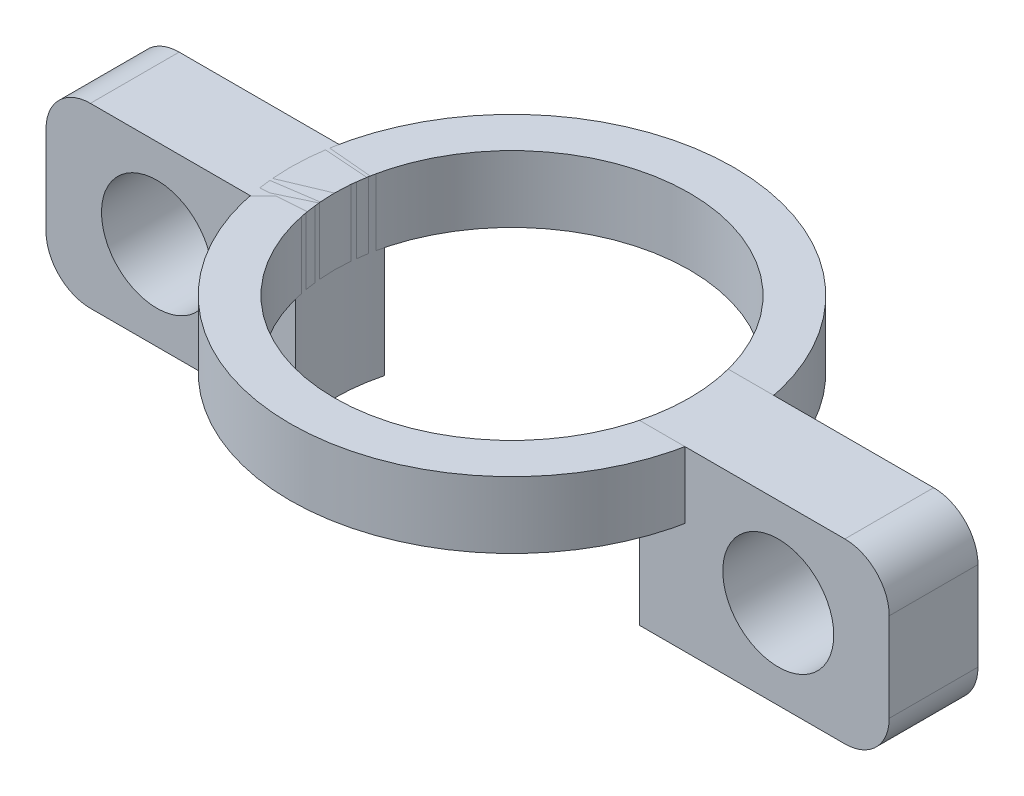
ISO-10303-21;
HEADER;
FILE_DESCRIPTION(('STEP AP214'),'2;1');
FILE_NAME('part.step','',(''),(''),'','','');
FILE_SCHEMA(('AUTOMOTIVE_DESIGN { 1 0 10303 214 1 1 1 1 }'));
ENDSEC;
DATA;
#1=APPLICATION_CONTEXT('core data for automotive mechanical design processes');
#2=APPLICATION_PROTOCOL_DEFINITION('international standard','automotive_design',2000,#1);
#3=PRODUCT_CONTEXT('',#1,'mechanical');
#4=PRODUCT('Part','Part','',(#3));
#5=PRODUCT_RELATED_PRODUCT_CATEGORY('part','',(#4));
#6=PRODUCT_DEFINITION_FORMATION('','',#4);
#7=PRODUCT_DEFINITION_CONTEXT('part definition',#1,'design');
#8=PRODUCT_DEFINITION('design','',#6,#7);
#9=PRODUCT_DEFINITION_SHAPE('','',#8);
#10=(LENGTH_UNIT() NAMED_UNIT(*) SI_UNIT(.MILLI.,.METRE.));
#11=(NAMED_UNIT(*) PLANE_ANGLE_UNIT() SI_UNIT($,.RADIAN.));
#12=(NAMED_UNIT(*) SI_UNIT($,.STERADIAN.) SOLID_ANGLE_UNIT());
#13=UNCERTAINTY_MEASURE_WITH_UNIT(LENGTH_MEASURE(1.E-05),#10,'distance_accuracy_value','');
#14=(GEOMETRIC_REPRESENTATION_CONTEXT(3) GLOBAL_UNCERTAINTY_ASSIGNED_CONTEXT((#13)) GLOBAL_UNIT_ASSIGNED_CONTEXT((#10,
#11,#12)) REPRESENTATION_CONTEXT('',''));
#15=CARTESIAN_POINT('',(0.,0.,0.));
#16=DIRECTION('',(0.,0.,1.));
#17=DIRECTION('',(1.,0.,0.));
#18=AXIS2_PLACEMENT_3D('',#15,#16,#17);
#19=CARTESIAN_POINT('',(0.,-50.,0.));
#20=DIRECTION('',(0.,1.,0.));
#21=DIRECTION('',(0.,0.,1.));
#22=AXIS2_PLACEMENT_3D('',#19,#20,#21);
#23=CYLINDRICAL_SURFACE('',#22,10.);
#24=CARTESIAN_POINT('',(0.,-50.,0.));
#25=DIRECTION('',(0.,1.,0.));
#26=DIRECTION('',(1.,0.,0.));
#27=AXIS2_PLACEMENT_3D('',#24,#25,#26);
#28=CIRCLE('',#27,10.);
#29=CARTESIAN_POINT('',(10.,-50.,0.));
#30=VERTEX_POINT('',#29);
#31=EDGE_CURVE('E12',#30,#30,#28,.T.);
#32=ORIENTED_EDGE('',*,*,#31,.T.);
#33=EDGE_LOOP('',(#32));
#34=FACE_BOUND('',#33,.T.);
#35=CARTESIAN_POINT('',(0.,-47.,0.));
#36=DIRECTION('',(0.,1.,0.));
#37=DIRECTION('',(1.,0.,0.));
#38=AXIS2_PLACEMENT_3D('',#35,#36,#37);
#39=CIRCLE('',#38,10.);
#40=CARTESIAN_POINT('',(10.,-47.,0.));
#41=VERTEX_POINT('',#40);
#42=EDGE_CURVE('E51',#41,#41,#39,.T.);
#43=ORIENTED_EDGE('',*,*,#42,.F.);
#44=EDGE_LOOP('',(#43));
#45=FACE_BOUND('',#44,.T.);
#46=ADVANCED_FACE('F48',(#34,#45),#23,.T.);
#47=CARTESIAN_POINT('',(0.,-50.,0.));
#48=DIRECTION('',(0.,1.,0.));
#49=DIRECTION('',(0.,0.,1.));
#50=AXIS2_PLACEMENT_3D('',#47,#48,#49);
#51=PLANE('',#50);
#52=CARTESIAN_POINT('',(0.,-50.,0.));
#53=DIRECTION('',(0.,1.,0.));
#54=DIRECTION('',(0.,0.,1.));
#55=AXIS2_PLACEMENT_3D('',#52,#53,#54);
#56=CIRCLE('',#55,8.);
#57=CARTESIAN_POINT('',(0.,-50.,8.));
#58=VERTEX_POINT('',#57);
#59=EDGE_CURVE('E58',#58,#58,#56,.T.);
#60=ORIENTED_EDGE('',*,*,#59,.T.);
#61=EDGE_LOOP('',(#60));
#62=FACE_BOUND('',#61,.T.);
#63=ORIENTED_EDGE('',*,*,#31,.F.);
#64=EDGE_LOOP('',(#63));
#65=FACE_BOUND('',#64,.T.);
#66=ADVANCED_FACE('F66',(#62,#65),#51,.F.);
#67=CARTESIAN_POINT('',(0.,-47.,0.));
#68=DIRECTION('',(0.,1.,0.));
#69=DIRECTION('',(0.,0.,1.));
#70=AXIS2_PLACEMENT_3D('',#67,#68,#69);
#71=PLANE('',#70);
#72=CARTESIAN_POINT('',(0.,-47.,0.));
#73=DIRECTION('',(0.,1.,0.));
#74=DIRECTION('',(0.,0.,1.));
#75=AXIS2_PLACEMENT_3D('',#72,#73,#74);
#76=CIRCLE('',#75,8.);
#77=CARTESIAN_POINT('',(0.,-47.,8.));
#78=VERTEX_POINT('',#77);
#79=EDGE_CURVE('E60',#78,#78,#76,.T.);
#80=ORIENTED_EDGE('',*,*,#79,.F.);
#81=EDGE_LOOP('',(#80));
#82=FACE_BOUND('',#81,.T.);
#83=ORIENTED_EDGE('',*,*,#42,.T.);
#84=EDGE_LOOP('',(#83));
#85=FACE_BOUND('',#84,.T.);
#86=ADVANCED_FACE('F72',(#82,#85),#71,.T.);
#87=CARTESIAN_POINT('',(0.,-50.,0.));
#88=DIRECTION('',(0.,1.,0.));
#89=DIRECTION('',(0.,0.,1.));
#90=AXIS2_PLACEMENT_3D('',#87,#88,#89);
#91=CYLINDRICAL_SURFACE('',#90,8.);
#92=ORIENTED_EDGE('',*,*,#59,.F.);
#93=EDGE_LOOP('',(#92));
#94=FACE_BOUND('',#93,.T.);
#95=ORIENTED_EDGE('',*,*,#79,.T.);
#96=EDGE_LOOP('',(#95));
#97=FACE_BOUND('',#96,.T.);
#98=ADVANCED_FACE('F69',(#94,#97),#91,.F.);
#99=CLOSED_SHELL('',(#46,#66,#86,#98));
#100=MANIFOLD_SOLID_BREP('B2',#99);
#101=CARTESIAN_POINT('',(0.,-47.,0.));
#102=DIRECTION('',(0.,-1.,0.));
#103=DIRECTION('',(0.,0.,1.));
#104=AXIS2_PLACEMENT_3D('',#101,#102,#103);
#105=CYLINDRICAL_SURFACE('',#104,8.);
#106=CARTESIAN_POINT('',(0.,-55.,0.));
#107=DIRECTION('',(0.,1.,0.));
#108=DIRECTION('',(0.,0.,1.));
#109=AXIS2_PLACEMENT_3D('',#106,#107,#108);
#110=CIRCLE('',#109,8.);
#111=CARTESIAN_POINT('',(7.74596669241483,-55.,2.));
#112=VERTEX_POINT('',#111);
#113=CARTESIAN_POINT('',(7.74596669241483,-55.,-2.));
#114=VERTEX_POINT('',#113);
#115=EDGE_CURVE('E201',#112,#114,#110,.T.);
#116=ORIENTED_EDGE('',*,*,#115,.F.);
#117=DIRECTION('',(0.,-1.,0.));
#118=VECTOR('',#117,1.);
#119=CARTESIAN_POINT('',(7.74596669241483,-47.,2.));
#120=LINE('',#119,#118);
#121=CARTESIAN_POINT('',(7.74596669241483,-47.,2.));
#122=VERTEX_POINT('',#121);
#123=EDGE_CURVE('E192',#122,#112,#120,.T.);
#124=ORIENTED_EDGE('',*,*,#123,.F.);
#125=CARTESIAN_POINT('',(0.,-47.,0.));
#126=DIRECTION('',(0.,1.,0.));
#127=DIRECTION('',(0.,0.,1.));
#128=AXIS2_PLACEMENT_3D('',#125,#126,#127);
#129=CIRCLE('',#128,8.);
#130=CARTESIAN_POINT('',(7.74596669241483,-47.,-2.));
#131=VERTEX_POINT('',#130);
#132=EDGE_CURVE('E188',#122,#131,#129,.T.);
#133=ORIENTED_EDGE('',*,*,#132,.T.);
#134=DIRECTION('',(0.,-1.,0.));
#135=VECTOR('',#134,1.);
#136=CARTESIAN_POINT('',(7.74596669241483,-47.,-2.));
#137=LINE('',#136,#135);
#138=EDGE_CURVE('E173',#131,#114,#137,.T.);
#139=ORIENTED_EDGE('',*,*,#138,.T.);
#140=EDGE_LOOP('',(#116,#124,#133,#139));
#141=FACE_BOUND('',#140,.T.);
#142=ADVANCED_FACE('F119',(#141),#105,.F.);
#143=CARTESIAN_POINT('',(7.74596669241483,-47.,2.));
#144=DIRECTION('',(0.,0.,1.));
#145=DIRECTION('',(1.,0.,0.));
#146=AXIS2_PLACEMENT_3D('',#143,#144,#145);
#147=PLANE('',#146);
#148=CARTESIAN_POINT('',(14.,-51.,2.));
#149=DIRECTION('',(0.,0.,1.));
#150=DIRECTION('',(1.,0.,0.));
#151=AXIS2_PLACEMENT_3D('',#148,#149,#150);
#152=CIRCLE('',#151,2.5);
#153=CARTESIAN_POINT('',(16.5,-51.,2.));
#154=VERTEX_POINT('',#153);
#155=EDGE_CURVE('E197',#154,#154,#152,.T.);
#156=ORIENTED_EDGE('',*,*,#155,.F.);
#157=EDGE_LOOP('',(#156));
#158=FACE_BOUND('',#157,.T.);
#159=DIRECTION('',(-1.,0.,0.));
#160=VECTOR('',#159,1.);
#161=CARTESIAN_POINT('',(7.74596669241483,-55.,2.));
#162=LINE('',#161,#160);
#163=CARTESIAN_POINT('',(17.,-55.,2.));
#164=VERTEX_POINT('',#163);
#165=EDGE_CURVE('E193',#164,#112,#162,.T.);
#166=ORIENTED_EDGE('',*,*,#165,.F.);
#167=CARTESIAN_POINT('',(17.,-53.,2.));
#168=DIRECTION('',(0.,0.,1.));
#169=DIRECTION('',(1.,0.,0.));
#170=AXIS2_PLACEMENT_3D('',#167,#168,#169);
#171=CIRCLE('',#170,2.);
#172=CARTESIAN_POINT('',(19.,-53.,2.));
#173=VERTEX_POINT('',#172);
#174=EDGE_CURVE('E214',#164,#173,#171,.T.);
#175=ORIENTED_EDGE('',*,*,#174,.T.);
#176=DIRECTION('',(0.,-1.,0.));
#177=VECTOR('',#176,1.);
#178=CARTESIAN_POINT('',(19.,-47.,2.));
#179=LINE('',#178,#177);
#180=CARTESIAN_POINT('',(19.,-49.,2.));
#181=VERTEX_POINT('',#180);
#182=EDGE_CURVE('E207',#181,#173,#179,.T.);
#183=ORIENTED_EDGE('',*,*,#182,.F.);
#184=CARTESIAN_POINT('',(17.,-49.,2.));
#185=DIRECTION('',(0.,0.,1.));
#186=DIRECTION('',(1.,0.,0.));
#187=AXIS2_PLACEMENT_3D('',#184,#185,#186);
#188=CIRCLE('',#187,2.);
#189=CARTESIAN_POINT('',(17.,-47.,2.));
#190=VERTEX_POINT('',#189);
#191=EDGE_CURVE('E212',#181,#190,#188,.T.);
#192=ORIENTED_EDGE('',*,*,#191,.T.);
#193=DIRECTION('',(-1.,0.,0.));
#194=VECTOR('',#193,1.);
#195=CARTESIAN_POINT('',(7.74596669241483,-47.,2.));
#196=LINE('',#195,#194);
#197=EDGE_CURVE('E184',#190,#122,#196,.T.);
#198=ORIENTED_EDGE('',*,*,#197,.T.);
#199=ORIENTED_EDGE('',*,*,#123,.T.);
#200=EDGE_LOOP('',(#166,#175,#183,#192,#198,#199));
#201=FACE_BOUND('',#200,.T.);
#202=ADVANCED_FACE('F230',(#158,#201),#147,.T.);
#203=CARTESIAN_POINT('',(19.,-47.,2.));
#204=DIRECTION('',(1.,0.,0.));
#205=DIRECTION('',(0.,0.,-1.));
#206=AXIS2_PLACEMENT_3D('',#203,#204,#205);
#207=PLANE('',#206);
#208=ORIENTED_EDGE('',*,*,#182,.T.);
#209=DIRECTION('',(0.,0.,1.));
#210=VECTOR('',#209,1.);
#211=CARTESIAN_POINT('',(19.,-53.,2.));
#212=LINE('',#211,#210);
#213=CARTESIAN_POINT('',(19.,-53.,-2.));
#214=VERTEX_POINT('',#213);
#215=EDGE_CURVE('E140',#173,#214,#212,.F.);
#216=ORIENTED_EDGE('',*,*,#215,.T.);
#217=DIRECTION('',(0.,-1.,0.));
#218=VECTOR('',#217,1.);
#219=CARTESIAN_POINT('',(19.,-47.,-2.));
#220=LINE('',#219,#218);
#221=CARTESIAN_POINT('',(19.,-49.,-2.));
#222=VERTEX_POINT('',#221);
#223=EDGE_CURVE('E183',#222,#214,#220,.T.);
#224=ORIENTED_EDGE('',*,*,#223,.F.);
#225=DIRECTION('',(0.,0.,1.));
#226=VECTOR('',#225,1.);
#227=CARTESIAN_POINT('',(19.,-49.,2.));
#228=LINE('',#227,#226);
#229=EDGE_CURVE('E216',#222,#181,#228,.T.);
#230=ORIENTED_EDGE('',*,*,#229,.T.);
#231=EDGE_LOOP('',(#208,#216,#224,#230));
#232=FACE_BOUND('',#231,.T.);
#233=ADVANCED_FACE('F231',(#232),#207,.T.);
#234=CARTESIAN_POINT('',(19.,-47.,-2.));
#235=DIRECTION('',(0.,0.,-1.));
#236=DIRECTION('',(-1.,0.,0.));
#237=AXIS2_PLACEMENT_3D('',#234,#235,#236);
#238=PLANE('',#237);
#239=CARTESIAN_POINT('',(14.,-51.,-2.));
#240=DIRECTION('',(0.,0.,1.));
#241=DIRECTION('',(1.,0.,0.));
#242=AXIS2_PLACEMENT_3D('',#239,#240,#241);
#243=CIRCLE('',#242,2.5);
#244=CARTESIAN_POINT('',(16.5,-51.,-2.));
#245=VERTEX_POINT('',#244);
#246=EDGE_CURVE('E203',#245,#245,#243,.T.);
#247=ORIENTED_EDGE('',*,*,#246,.T.);
#248=EDGE_LOOP('',(#247));
#249=FACE_BOUND('',#248,.T.);
#250=ORIENTED_EDGE('',*,*,#223,.T.);
#251=CARTESIAN_POINT('',(17.,-53.,-2.));
#252=DIRECTION('',(0.,0.,-1.));
#253=DIRECTION('',(-1.,0.,0.));
#254=AXIS2_PLACEMENT_3D('',#251,#252,#253);
#255=CIRCLE('',#254,2.);
#256=CARTESIAN_POINT('',(17.,-55.,-2.));
#257=VERTEX_POINT('',#256);
#258=EDGE_CURVE('E127',#214,#257,#255,.T.);
#259=ORIENTED_EDGE('',*,*,#258,.T.);
#260=DIRECTION('',(1.,0.,0.));
#261=VECTOR('',#260,1.);
#262=CARTESIAN_POINT('',(19.,-55.,-2.));
#263=LINE('',#262,#261);
#264=EDGE_CURVE('E178',#114,#257,#263,.T.);
#265=ORIENTED_EDGE('',*,*,#264,.F.);
#266=ORIENTED_EDGE('',*,*,#138,.F.);
#267=DIRECTION('',(1.,0.,0.));
#268=VECTOR('',#267,1.);
#269=CARTESIAN_POINT('',(19.,-47.,-2.));
#270=LINE('',#269,#268);
#271=CARTESIAN_POINT('',(17.,-47.,-2.));
#272=VERTEX_POINT('',#271);
#273=EDGE_CURVE('E175',#131,#272,#270,.T.);
#274=ORIENTED_EDGE('',*,*,#273,.T.);
#275=CARTESIAN_POINT('',(17.,-49.,-2.));
#276=DIRECTION('',(0.,0.,-1.));
#277=DIRECTION('',(-1.,0.,0.));
#278=AXIS2_PLACEMENT_3D('',#275,#276,#277);
#279=CIRCLE('',#278,2.);
#280=EDGE_CURVE('E220',#272,#222,#279,.T.);
#281=ORIENTED_EDGE('',*,*,#280,.T.);
#282=EDGE_LOOP('',(#250,#259,#265,#266,#274,#281));
#283=FACE_BOUND('',#282,.T.);
#284=ADVANCED_FACE('F174',(#249,#283),#238,.T.);
#285=CARTESIAN_POINT('',(0.,-47.,0.));
#286=DIRECTION('',(0.,-1.,0.));
#287=DIRECTION('',(0.,0.,1.));
#288=AXIS2_PLACEMENT_3D('',#285,#286,#287);
#289=PLANE('',#288);
#290=ORIENTED_EDGE('',*,*,#197,.F.);
#291=DIRECTION('',(0.,0.,1.));
#292=VECTOR('',#291,1.);
#293=CARTESIAN_POINT('',(17.,-47.,-2.));
#294=LINE('',#293,#292);
#295=EDGE_CURVE('E46',#190,#272,#294,.F.);
#296=ORIENTED_EDGE('',*,*,#295,.T.);
#297=ORIENTED_EDGE('',*,*,#273,.F.);
#298=ORIENTED_EDGE('',*,*,#132,.F.);
#299=EDGE_LOOP('',(#290,#296,#297,#298));
#300=FACE_BOUND('',#299,.T.);
#301=ADVANCED_FACE('F187',(#300),#289,.F.);
#302=CARTESIAN_POINT('',(0.,-55.,0.));
#303=DIRECTION('',(0.,-1.,0.));
#304=DIRECTION('',(0.,0.,1.));
#305=AXIS2_PLACEMENT_3D('',#302,#303,#304);
#306=PLANE('',#305);
#307=ORIENTED_EDGE('',*,*,#264,.T.);
#308=DIRECTION('',(0.,0.,1.));
#309=VECTOR('',#308,1.);
#310=CARTESIAN_POINT('',(17.,-55.,0.));
#311=LINE('',#310,#309);
#312=EDGE_CURVE('E206',#257,#164,#311,.T.);
#313=ORIENTED_EDGE('',*,*,#312,.T.);
#314=ORIENTED_EDGE('',*,*,#165,.T.);
#315=ORIENTED_EDGE('',*,*,#115,.T.);
#316=EDGE_LOOP('',(#307,#313,#314,#315));
#317=FACE_BOUND('',#316,.T.);
#318=ADVANCED_FACE('F225',(#317),#306,.T.);
#319=CARTESIAN_POINT('',(14.,-51.,-2.));
#320=DIRECTION('',(0.,0.,1.));
#321=DIRECTION('',(1.,0.,0.));
#322=AXIS2_PLACEMENT_3D('',#319,#320,#321);
#323=CYLINDRICAL_SURFACE('',#322,2.5);
#324=ORIENTED_EDGE('',*,*,#246,.F.);
#325=EDGE_LOOP('',(#324));
#326=FACE_BOUND('',#325,.T.);
#327=ORIENTED_EDGE('',*,*,#155,.T.);
#328=EDGE_LOOP('',(#327));
#329=FACE_BOUND('',#328,.T.);
#330=ADVANCED_FACE('F238',(#326,#329),#323,.F.);
#331=CARTESIAN_POINT('',(17.,-53.,0.));
#332=DIRECTION('',(0.,0.,1.));
#333=DIRECTION('',(1.,0.,0.));
#334=AXIS2_PLACEMENT_3D('',#331,#332,#333);
#335=CYLINDRICAL_SURFACE('',#334,2.);
#336=ORIENTED_EDGE('',*,*,#258,.F.);
#337=ORIENTED_EDGE('',*,*,#215,.F.);
#338=ORIENTED_EDGE('',*,*,#174,.F.);
#339=ORIENTED_EDGE('',*,*,#312,.F.);
#340=EDGE_LOOP('',(#336,#337,#338,#339));
#341=FACE_BOUND('',#340,.T.);
#342=ADVANCED_FACE('F227',(#341),#335,.T.);
#343=CARTESIAN_POINT('',(17.,-49.,2.));
#344=DIRECTION('',(0.,0.,-1.));
#345=DIRECTION('',(-1.,0.,0.));
#346=AXIS2_PLACEMENT_3D('',#343,#344,#345);
#347=CYLINDRICAL_SURFACE('',#346,2.);
#348=ORIENTED_EDGE('',*,*,#280,.F.);
#349=ORIENTED_EDGE('',*,*,#295,.F.);
#350=ORIENTED_EDGE('',*,*,#191,.F.);
#351=ORIENTED_EDGE('',*,*,#229,.F.);
#352=EDGE_LOOP('',(#348,#349,#350,#351));
#353=FACE_BOUND('',#352,.T.);
#354=ADVANCED_FACE('F121',(#353),#347,.T.);
#355=CLOSED_SHELL('',(#142,#202,#233,#284,#301,#318,#330,#342,#354));
#356=MANIFOLD_SOLID_BREP('B7',#355);
#357=CARTESIAN_POINT('',(0.,-47.,0.));
#358=DIRECTION('',(0.,-1.,0.));
#359=DIRECTION('',(0.,0.,-1.));
#360=AXIS2_PLACEMENT_3D('',#357,#358,#359);
#361=CYLINDRICAL_SURFACE('',#360,8.);
#362=CARTESIAN_POINT('',(0.,-55.,0.));
#363=DIRECTION('',(0.,1.,0.));
#364=DIRECTION('',(0.,0.,-1.));
#365=AXIS2_PLACEMENT_3D('',#362,#363,#364);
#366=CIRCLE('',#365,8.);
#367=CARTESIAN_POINT('',(-7.74596669241483,-55.,-2.));
#368=VERTEX_POINT('',#367);
#369=CARTESIAN_POINT('',(-7.74596669241483,-55.,2.));
#370=VERTEX_POINT('',#369);
#371=EDGE_CURVE('E398',#368,#370,#366,.T.);
#372=ORIENTED_EDGE('',*,*,#371,.F.);
#373=DIRECTION('',(0.,-1.,0.));
#374=VECTOR('',#373,1.);
#375=CARTESIAN_POINT('',(-7.74596669241483,-47.,-2.));
#376=LINE('',#375,#374);
#377=CARTESIAN_POINT('',(-7.74596669241483,-47.,-2.));
#378=VERTEX_POINT('',#377);
#379=EDGE_CURVE('E389',#378,#368,#376,.T.);
#380=ORIENTED_EDGE('',*,*,#379,.F.);
#381=CARTESIAN_POINT('',(0.,-47.,0.));
#382=DIRECTION('',(0.,1.,0.));
#383=DIRECTION('',(0.,0.,-1.));
#384=AXIS2_PLACEMENT_3D('',#381,#382,#383);
#385=CIRCLE('',#384,8.);
#386=CARTESIAN_POINT('',(-7.74596669241483,-47.,2.));
#387=VERTEX_POINT('',#386);
#388=EDGE_CURVE('E385',#378,#387,#385,.T.);
#389=ORIENTED_EDGE('',*,*,#388,.T.);
#390=DIRECTION('',(0.,-1.,0.));
#391=VECTOR('',#390,1.);
#392=CARTESIAN_POINT('',(-7.74596669241483,-47.,2.));
#393=LINE('',#392,#391);
#394=EDGE_CURVE('E370',#387,#370,#393,.T.);
#395=ORIENTED_EDGE('',*,*,#394,.T.);
#396=EDGE_LOOP('',(#372,#380,#389,#395));
#397=FACE_BOUND('',#396,.T.);
#398=ADVANCED_FACE('F316',(#397),#361,.F.);
#399=CARTESIAN_POINT('',(-7.74596669241483,-47.,-2.));
#400=DIRECTION('',(0.,0.,-1.));
#401=DIRECTION('',(-1.,0.,0.));
#402=AXIS2_PLACEMENT_3D('',#399,#400,#401);
#403=PLANE('',#402);
#404=CARTESIAN_POINT('',(-14.,-51.,-2.));
#405=DIRECTION('',(0.,0.,-1.));
#406=DIRECTION('',(-1.,0.,0.));
#407=AXIS2_PLACEMENT_3D('',#404,#405,#406);
#408=CIRCLE('',#407,2.5);
#409=CARTESIAN_POINT('',(-16.5,-51.,-2.));
#410=VERTEX_POINT('',#409);
#411=EDGE_CURVE('E394',#410,#410,#408,.T.);
#412=ORIENTED_EDGE('',*,*,#411,.F.);
#413=EDGE_LOOP('',(#412));
#414=FACE_BOUND('',#413,.T.);
#415=DIRECTION('',(1.,0.,0.));
#416=VECTOR('',#415,1.);
#417=CARTESIAN_POINT('',(-7.74596669241483,-55.,-2.));
#418=LINE('',#417,#416);
#419=CARTESIAN_POINT('',(-17.,-55.,-2.));
#420=VERTEX_POINT('',#419);
#421=EDGE_CURVE('E390',#420,#368,#418,.T.);
#422=ORIENTED_EDGE('',*,*,#421,.F.);
#423=CARTESIAN_POINT('',(-17.,-53.,-2.));
#424=DIRECTION('',(0.,0.,-1.));
#425=DIRECTION('',(-1.,0.,0.));
#426=AXIS2_PLACEMENT_3D('',#423,#424,#425);
#427=CIRCLE('',#426,2.);
#428=CARTESIAN_POINT('',(-19.,-53.,-2.));
#429=VERTEX_POINT('',#428);
#430=EDGE_CURVE('E411',#420,#429,#427,.T.);
#431=ORIENTED_EDGE('',*,*,#430,.T.);
#432=DIRECTION('',(0.,-1.,0.));
#433=VECTOR('',#432,1.);
#434=CARTESIAN_POINT('',(-19.,-47.,-2.));
#435=LINE('',#434,#433);
#436=CARTESIAN_POINT('',(-19.,-49.,-2.));
#437=VERTEX_POINT('',#436);
#438=EDGE_CURVE('E404',#437,#429,#435,.T.);
#439=ORIENTED_EDGE('',*,*,#438,.F.);
#440=CARTESIAN_POINT('',(-17.,-49.,-2.));
#441=DIRECTION('',(0.,0.,-1.));
#442=DIRECTION('',(-1.,0.,0.));
#443=AXIS2_PLACEMENT_3D('',#440,#441,#442);
#444=CIRCLE('',#443,2.);
#445=CARTESIAN_POINT('',(-17.,-47.,-2.));
#446=VERTEX_POINT('',#445);
#447=EDGE_CURVE('E409',#437,#446,#444,.T.);
#448=ORIENTED_EDGE('',*,*,#447,.T.);
#449=DIRECTION('',(1.,0.,0.));
#450=VECTOR('',#449,1.);
#451=CARTESIAN_POINT('',(-7.74596669241483,-47.,-2.));
#452=LINE('',#451,#450);
#453=EDGE_CURVE('E381',#446,#378,#452,.T.);
#454=ORIENTED_EDGE('',*,*,#453,.T.);
#455=ORIENTED_EDGE('',*,*,#379,.T.);
#456=EDGE_LOOP('',(#422,#431,#439,#448,#454,#455));
#457=FACE_BOUND('',#456,.T.);
#458=ADVANCED_FACE('F427',(#414,#457),#403,.T.);
#459=CARTESIAN_POINT('',(-19.,-47.,-2.));
#460=DIRECTION('',(-1.,0.,0.));
#461=DIRECTION('',(0.,0.,1.));
#462=AXIS2_PLACEMENT_3D('',#459,#460,#461);
#463=PLANE('',#462);
#464=ORIENTED_EDGE('',*,*,#438,.T.);
#465=DIRECTION('',(0.,0.,-1.));
#466=VECTOR('',#465,1.);
#467=CARTESIAN_POINT('',(-19.,-53.,-2.));
#468=LINE('',#467,#466);
#469=CARTESIAN_POINT('',(-19.,-53.,2.));
#470=VERTEX_POINT('',#469);
#471=EDGE_CURVE('E337',#429,#470,#468,.F.);
#472=ORIENTED_EDGE('',*,*,#471,.T.);
#473=DIRECTION('',(0.,-1.,0.));
#474=VECTOR('',#473,1.);
#475=CARTESIAN_POINT('',(-19.,-47.,2.));
#476=LINE('',#475,#474);
#477=CARTESIAN_POINT('',(-19.,-49.,2.));
#478=VERTEX_POINT('',#477);
#479=EDGE_CURVE('E380',#478,#470,#476,.T.);
#480=ORIENTED_EDGE('',*,*,#479,.F.);
#481=DIRECTION('',(0.,0.,-1.));
#482=VECTOR('',#481,1.);
#483=CARTESIAN_POINT('',(-19.,-49.,-2.));
#484=LINE('',#483,#482);
#485=EDGE_CURVE('E413',#478,#437,#484,.T.);
#486=ORIENTED_EDGE('',*,*,#485,.T.);
#487=EDGE_LOOP('',(#464,#472,#480,#486));
#488=FACE_BOUND('',#487,.T.);
#489=ADVANCED_FACE('F428',(#488),#463,.T.);
#490=CARTESIAN_POINT('',(-19.,-47.,2.));
#491=DIRECTION('',(0.,0.,1.));
#492=DIRECTION('',(1.,0.,0.));
#493=AXIS2_PLACEMENT_3D('',#490,#491,#492);
#494=PLANE('',#493);
#495=CARTESIAN_POINT('',(-14.,-51.,2.));
#496=DIRECTION('',(0.,0.,-1.));
#497=DIRECTION('',(-1.,0.,0.));
#498=AXIS2_PLACEMENT_3D('',#495,#496,#497);
#499=CIRCLE('',#498,2.5);
#500=CARTESIAN_POINT('',(-16.5,-51.,2.));
#501=VERTEX_POINT('',#500);
#502=EDGE_CURVE('E400',#501,#501,#499,.T.);
#503=ORIENTED_EDGE('',*,*,#502,.T.);
#504=EDGE_LOOP('',(#503));
#505=FACE_BOUND('',#504,.T.);
#506=ORIENTED_EDGE('',*,*,#479,.T.);
#507=CARTESIAN_POINT('',(-17.,-53.,2.));
#508=DIRECTION('',(0.,0.,1.));
#509=DIRECTION('',(1.,0.,0.));
#510=AXIS2_PLACEMENT_3D('',#507,#508,#509);
#511=CIRCLE('',#510,2.);
#512=CARTESIAN_POINT('',(-17.,-55.,2.));
#513=VERTEX_POINT('',#512);
#514=EDGE_CURVE('E324',#470,#513,#511,.T.);
#515=ORIENTED_EDGE('',*,*,#514,.T.);
#516=DIRECTION('',(-1.,0.,0.));
#517=VECTOR('',#516,1.);
#518=CARTESIAN_POINT('',(-19.,-55.,2.));
#519=LINE('',#518,#517);
#520=EDGE_CURVE('E375',#370,#513,#519,.T.);
#521=ORIENTED_EDGE('',*,*,#520,.F.);
#522=ORIENTED_EDGE('',*,*,#394,.F.);
#523=DIRECTION('',(-1.,0.,0.));
#524=VECTOR('',#523,1.);
#525=CARTESIAN_POINT('',(-19.,-47.,2.));
#526=LINE('',#525,#524);
#527=CARTESIAN_POINT('',(-17.,-47.,2.));
#528=VERTEX_POINT('',#527);
#529=EDGE_CURVE('E372',#387,#528,#526,.T.);
#530=ORIENTED_EDGE('',*,*,#529,.T.);
#531=CARTESIAN_POINT('',(-17.,-49.,2.));
#532=DIRECTION('',(0.,0.,1.));
#533=DIRECTION('',(1.,0.,0.));
#534=AXIS2_PLACEMENT_3D('',#531,#532,#533);
#535=CIRCLE('',#534,2.);
#536=EDGE_CURVE('E417',#528,#478,#535,.T.);
#537=ORIENTED_EDGE('',*,*,#536,.T.);
#538=EDGE_LOOP('',(#506,#515,#521,#522,#530,#537));
#539=FACE_BOUND('',#538,.T.);
#540=ADVANCED_FACE('F371',(#505,#539),#494,.T.);
#541=CARTESIAN_POINT('',(0.,-47.,0.));
#542=DIRECTION('',(0.,-1.,0.));
#543=DIRECTION('',(0.,0.,-1.));
#544=AXIS2_PLACEMENT_3D('',#541,#542,#543);
#545=PLANE('',#544);
#546=ORIENTED_EDGE('',*,*,#453,.F.);
#547=DIRECTION('',(0.,0.,-1.));
#548=VECTOR('',#547,1.);
#549=CARTESIAN_POINT('',(-17.,-47.,2.));
#550=LINE('',#549,#548);
#551=EDGE_CURVE('E117',#446,#528,#550,.F.);
#552=ORIENTED_EDGE('',*,*,#551,.T.);
#553=ORIENTED_EDGE('',*,*,#529,.F.);
#554=ORIENTED_EDGE('',*,*,#388,.F.);
#555=EDGE_LOOP('',(#546,#552,#553,#554));
#556=FACE_BOUND('',#555,.T.);
#557=ADVANCED_FACE('F384',(#556),#545,.F.);
#558=CARTESIAN_POINT('',(0.,-55.,0.));
#559=DIRECTION('',(0.,-1.,0.));
#560=DIRECTION('',(0.,0.,-1.));
#561=AXIS2_PLACEMENT_3D('',#558,#559,#560);
#562=PLANE('',#561);
#563=ORIENTED_EDGE('',*,*,#520,.T.);
#564=DIRECTION('',(0.,0.,-1.));
#565=VECTOR('',#564,1.);
#566=CARTESIAN_POINT('',(-17.,-55.,0.));
#567=LINE('',#566,#565);
#568=EDGE_CURVE('E403',#513,#420,#567,.T.);
#569=ORIENTED_EDGE('',*,*,#568,.T.);
#570=ORIENTED_EDGE('',*,*,#421,.T.);
#571=ORIENTED_EDGE('',*,*,#371,.T.);
#572=EDGE_LOOP('',(#563,#569,#570,#571));
#573=FACE_BOUND('',#572,.T.);
#574=ADVANCED_FACE('F422',(#573),#562,.T.);
#575=CARTESIAN_POINT('',(-14.,-51.,2.));
#576=DIRECTION('',(0.,0.,-1.));
#577=DIRECTION('',(-1.,0.,0.));
#578=AXIS2_PLACEMENT_3D('',#575,#576,#577);
#579=CYLINDRICAL_SURFACE('',#578,2.5);
#580=ORIENTED_EDGE('',*,*,#502,.F.);
#581=EDGE_LOOP('',(#580));
#582=FACE_BOUND('',#581,.T.);
#583=ORIENTED_EDGE('',*,*,#411,.T.);
#584=EDGE_LOOP('',(#583));
#585=FACE_BOUND('',#584,.T.);
#586=ADVANCED_FACE('F435',(#582,#585),#579,.F.);
#587=CARTESIAN_POINT('',(-17.,-53.,0.));
#588=DIRECTION('',(0.,0.,-1.));
#589=DIRECTION('',(-1.,0.,0.));
#590=AXIS2_PLACEMENT_3D('',#587,#588,#589);
#591=CYLINDRICAL_SURFACE('',#590,2.);
#592=ORIENTED_EDGE('',*,*,#514,.F.);
#593=ORIENTED_EDGE('',*,*,#471,.F.);
#594=ORIENTED_EDGE('',*,*,#430,.F.);
#595=ORIENTED_EDGE('',*,*,#568,.F.);
#596=EDGE_LOOP('',(#592,#593,#594,#595));
#597=FACE_BOUND('',#596,.T.);
#598=ADVANCED_FACE('F424',(#597),#591,.T.);
#599=CARTESIAN_POINT('',(-17.,-49.,-2.));
#600=DIRECTION('',(0.,0.,1.));
#601=DIRECTION('',(1.,0.,0.));
#602=AXIS2_PLACEMENT_3D('',#599,#600,#601);
#603=CYLINDRICAL_SURFACE('',#602,2.);
#604=ORIENTED_EDGE('',*,*,#536,.F.);
#605=ORIENTED_EDGE('',*,*,#551,.F.);
#606=ORIENTED_EDGE('',*,*,#447,.F.);
#607=ORIENTED_EDGE('',*,*,#485,.F.);
#608=EDGE_LOOP('',(#604,#605,#606,#607));
#609=FACE_BOUND('',#608,.T.);
#610=ADVANCED_FACE('F318',(#609),#603,.T.);
#611=CLOSED_SHELL('',(#398,#458,#489,#540,#557,#574,#586,#598,#610));
#612=MANIFOLD_SOLID_BREP('B40',#611);
#613=ADVANCED_BREP_SHAPE_REPRESENTATION('',(#18,#100,#356,#612),#14);
#614=SHAPE_DEFINITION_REPRESENTATION(#9,#613);
ENDSEC;
END-ISO-10303-21;
